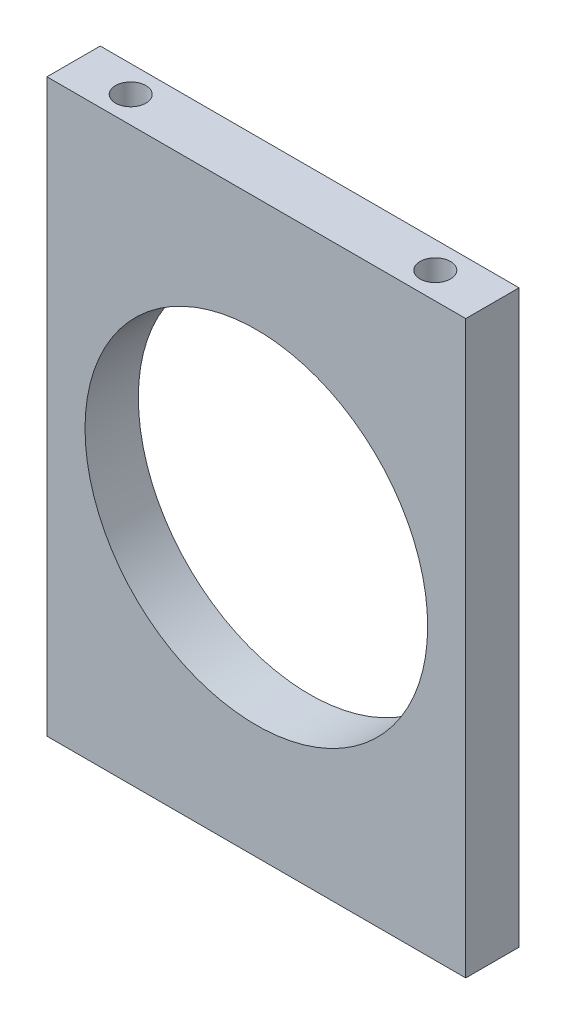
ISO-10303-21;
HEADER;
FILE_DESCRIPTION(('STEP AP214'),'2;1');
FILE_NAME('part.step','',(''),(''),'','','');
FILE_SCHEMA(('AUTOMOTIVE_DESIGN { 1 0 10303 214 1 1 1 1 }'));
ENDSEC;
DATA;
#1=APPLICATION_CONTEXT('core data for automotive mechanical design processes');
#2=APPLICATION_PROTOCOL_DEFINITION('international standard','automotive_design',2000,#1);
#3=PRODUCT_CONTEXT('',#1,'mechanical');
#4=PRODUCT('Part','Part','',(#3));
#5=PRODUCT_RELATED_PRODUCT_CATEGORY('part','',(#4));
#6=PRODUCT_DEFINITION_FORMATION('','',#4);
#7=PRODUCT_DEFINITION_CONTEXT('part definition',#1,'design');
#8=PRODUCT_DEFINITION('design','',#6,#7);
#9=PRODUCT_DEFINITION_SHAPE('','',#8);
#10=(LENGTH_UNIT() NAMED_UNIT(*) SI_UNIT(.MILLI.,.METRE.));
#11=(NAMED_UNIT(*) PLANE_ANGLE_UNIT() SI_UNIT($,.RADIAN.));
#12=(NAMED_UNIT(*) SI_UNIT($,.STERADIAN.) SOLID_ANGLE_UNIT());
#13=UNCERTAINTY_MEASURE_WITH_UNIT(LENGTH_MEASURE(1.E-05),#10,'distance_accuracy_value','');
#14=(GEOMETRIC_REPRESENTATION_CONTEXT(3) GLOBAL_UNCERTAINTY_ASSIGNED_CONTEXT((#13)) GLOBAL_UNIT_ASSIGNED_CONTEXT((#10,
#11,#12)) REPRESENTATION_CONTEXT('',''));
#15=CARTESIAN_POINT('',(0.,0.,0.));
#16=DIRECTION('',(0.,0.,1.));
#17=DIRECTION('',(1.,0.,0.));
#18=AXIS2_PLACEMENT_3D('',#15,#16,#17);
#19=CARTESIAN_POINT('',(0.,0.,7.));
#20=DIRECTION('',(0.,0.,1.));
#21=DIRECTION('',(1.,0.,0.));
#22=AXIS2_PLACEMENT_3D('',#19,#20,#21);
#23=PLANE('',#22);
#24=DIRECTION('',(0.,1.,0.));
#25=VECTOR('',#24,1.);
#26=CARTESIAN_POINT('',(27.5,37.5,7.));
#27=LINE('',#26,#25);
#28=CARTESIAN_POINT('',(27.5,-37.5,7.));
#29=VERTEX_POINT('',#28);
#30=CARTESIAN_POINT('',(27.5,37.5,7.));
#31=VERTEX_POINT('',#30);
#32=EDGE_CURVE('E86',#29,#31,#27,.T.);
#33=ORIENTED_EDGE('',*,*,#32,.T.);
#34=DIRECTION('',(-1.,0.,0.));
#35=VECTOR('',#34,1.);
#36=CARTESIAN_POINT('',(-27.5,37.5,7.));
#37=LINE('',#36,#35);
#38=CARTESIAN_POINT('',(-27.5,37.5,7.));
#39=VERTEX_POINT('',#38);
#40=EDGE_CURVE('E81',#31,#39,#37,.T.);
#41=ORIENTED_EDGE('',*,*,#40,.T.);
#42=DIRECTION('',(0.,-1.,0.));
#43=VECTOR('',#42,1.);
#44=CARTESIAN_POINT('',(-27.5,37.5,7.));
#45=LINE('',#44,#43);
#46=CARTESIAN_POINT('',(-27.5,-37.5,7.));
#47=VERTEX_POINT('',#46);
#48=EDGE_CURVE('E84',#39,#47,#45,.T.);
#49=ORIENTED_EDGE('',*,*,#48,.T.);
#50=DIRECTION('',(1.,0.,0.));
#51=VECTOR('',#50,1.);
#52=CARTESIAN_POINT('',(-27.5,-37.5,7.));
#53=LINE('',#52,#51);
#54=EDGE_CURVE('E51',#47,#29,#53,.T.);
#55=ORIENTED_EDGE('',*,*,#54,.T.);
#56=EDGE_LOOP('',(#33,#41,#49,#55));
#57=FACE_BOUND('',#56,.T.);
#58=CARTESIAN_POINT('',(0.,0.,7.));
#59=DIRECTION('',(0.,0.,1.));
#60=DIRECTION('',(1.,0.,0.));
#61=AXIS2_PLACEMENT_3D('',#58,#59,#60);
#62=CIRCLE('',#61,22.5);
#63=CARTESIAN_POINT('',(22.5,0.,7.));
#64=VERTEX_POINT('',#63);
#65=EDGE_CURVE('E101',#64,#64,#62,.T.);
#66=ORIENTED_EDGE('',*,*,#65,.F.);
#67=EDGE_LOOP('',(#66));
#68=FACE_BOUND('',#67,.T.);
#69=ADVANCED_FACE('F34',(#57,#68),#23,.T.);
#70=CARTESIAN_POINT('',(0.,0.,0.));
#71=DIRECTION('',(0.,0.,1.));
#72=DIRECTION('',(1.,0.,0.));
#73=AXIS2_PLACEMENT_3D('',#70,#71,#72);
#74=PLANE('',#73);
#75=DIRECTION('',(0.,1.,0.));
#76=VECTOR('',#75,1.);
#77=CARTESIAN_POINT('',(27.5,37.5,0.));
#78=LINE('',#77,#76);
#79=CARTESIAN_POINT('',(27.5,-37.5,0.));
#80=VERTEX_POINT('',#79);
#81=CARTESIAN_POINT('',(27.5,37.5,0.));
#82=VERTEX_POINT('',#81);
#83=EDGE_CURVE('E98',#80,#82,#78,.T.);
#84=ORIENTED_EDGE('',*,*,#83,.F.);
#85=DIRECTION('',(1.,0.,0.));
#86=VECTOR('',#85,1.);
#87=CARTESIAN_POINT('',(-27.5,-37.5,0.));
#88=LINE('',#87,#86);
#89=CARTESIAN_POINT('',(-27.5,-37.5,0.));
#90=VERTEX_POINT('',#89);
#91=EDGE_CURVE('E74',#90,#80,#88,.T.);
#92=ORIENTED_EDGE('',*,*,#91,.F.);
#93=DIRECTION('',(0.,-1.,0.));
#94=VECTOR('',#93,1.);
#95=CARTESIAN_POINT('',(-27.5,37.5,0.));
#96=LINE('',#95,#94);
#97=CARTESIAN_POINT('',(-27.5,37.5,0.));
#98=VERTEX_POINT('',#97);
#99=EDGE_CURVE('E68',#98,#90,#96,.T.);
#100=ORIENTED_EDGE('',*,*,#99,.F.);
#101=DIRECTION('',(-1.,0.,0.));
#102=VECTOR('',#101,1.);
#103=CARTESIAN_POINT('',(-27.5,37.5,0.));
#104=LINE('',#103,#102);
#105=EDGE_CURVE('E90',#82,#98,#104,.T.);
#106=ORIENTED_EDGE('',*,*,#105,.F.);
#107=EDGE_LOOP('',(#84,#92,#100,#106));
#108=FACE_BOUND('',#107,.T.);
#109=CARTESIAN_POINT('',(0.,0.,0.));
#110=DIRECTION('',(0.,0.,1.));
#111=DIRECTION('',(1.,0.,0.));
#112=AXIS2_PLACEMENT_3D('',#109,#110,#111);
#113=CIRCLE('',#112,22.5);
#114=CARTESIAN_POINT('',(22.5,0.,0.));
#115=VERTEX_POINT('',#114);
#116=EDGE_CURVE('E113',#115,#115,#113,.T.);
#117=ORIENTED_EDGE('',*,*,#116,.T.);
#118=EDGE_LOOP('',(#117));
#119=FACE_BOUND('',#118,.T.);
#120=ADVANCED_FACE('F109',(#108,#119),#74,.F.);
#121=CARTESIAN_POINT('',(27.5,37.5,7.));
#122=DIRECTION('',(-1.,0.,0.));
#123=DIRECTION('',(0.,-1.,0.));
#124=AXIS2_PLACEMENT_3D('',#121,#122,#123);
#125=PLANE('',#124);
#126=ORIENTED_EDGE('',*,*,#83,.T.);
#127=DIRECTION('',(0.,0.,-1.));
#128=VECTOR('',#127,1.);
#129=CARTESIAN_POINT('',(27.5,37.5,7.));
#130=LINE('',#129,#128);
#131=EDGE_CURVE('E11',#31,#82,#130,.T.);
#132=ORIENTED_EDGE('',*,*,#131,.F.);
#133=ORIENTED_EDGE('',*,*,#32,.F.);
#134=DIRECTION('',(0.,0.,-1.));
#135=VECTOR('',#134,1.);
#136=CARTESIAN_POINT('',(27.5,-37.5,7.));
#137=LINE('',#136,#135);
#138=EDGE_CURVE('E94',#29,#80,#137,.T.);
#139=ORIENTED_EDGE('',*,*,#138,.T.);
#140=EDGE_LOOP('',(#126,#132,#133,#139));
#141=FACE_BOUND('',#140,.T.);
#142=ADVANCED_FACE('F36',(#141),#125,.F.);
#143=CARTESIAN_POINT('',(-27.5,37.5,7.));
#144=DIRECTION('',(0.,-1.,0.));
#145=DIRECTION('',(0.,0.,-1.));
#146=AXIS2_PLACEMENT_3D('',#143,#144,#145);
#147=PLANE('',#146);
#148=CARTESIAN_POINT('',(-20.,37.5,3.5));
#149=DIRECTION('',(0.,1.,0.));
#150=DIRECTION('',(0.,0.,1.));
#151=AXIS2_PLACEMENT_3D('',#148,#149,#150);
#152=CIRCLE('',#151,2.);
#153=CARTESIAN_POINT('',(-20.,37.5,5.5));
#154=VERTEX_POINT('',#153);
#155=EDGE_CURVE('E126',#154,#154,#152,.T.);
#156=ORIENTED_EDGE('',*,*,#155,.F.);
#157=EDGE_LOOP('',(#156));
#158=FACE_BOUND('',#157,.T.);
#159=CARTESIAN_POINT('',(20.,37.5,3.50000000000008));
#160=DIRECTION('',(0.,1.,0.));
#161=DIRECTION('',(0.,0.,-1.));
#162=AXIS2_PLACEMENT_3D('',#159,#160,#161);
#163=CIRCLE('',#162,2.);
#164=CARTESIAN_POINT('',(20.,37.5,1.50000000000007));
#165=VERTEX_POINT('',#164);
#166=EDGE_CURVE('E119',#165,#165,#163,.T.);
#167=ORIENTED_EDGE('',*,*,#166,.F.);
#168=EDGE_LOOP('',(#167));
#169=FACE_BOUND('',#168,.T.);
#170=ORIENTED_EDGE('',*,*,#105,.T.);
#171=DIRECTION('',(0.,0.,-1.));
#172=VECTOR('',#171,1.);
#173=CARTESIAN_POINT('',(-27.5,37.5,7.));
#174=LINE('',#173,#172);
#175=EDGE_CURVE('E43',#39,#98,#174,.T.);
#176=ORIENTED_EDGE('',*,*,#175,.F.);
#177=ORIENTED_EDGE('',*,*,#40,.F.);
#178=ORIENTED_EDGE('',*,*,#131,.T.);
#179=EDGE_LOOP('',(#170,#176,#177,#178));
#180=FACE_BOUND('',#179,.T.);
#181=ADVANCED_FACE('F89',(#158,#169,#180),#147,.F.);
#182=CARTESIAN_POINT('',(-27.5,37.5,7.));
#183=DIRECTION('',(1.,0.,0.));
#184=DIRECTION('',(0.,1.,0.));
#185=AXIS2_PLACEMENT_3D('',#182,#183,#184);
#186=PLANE('',#185);
#187=ORIENTED_EDGE('',*,*,#99,.T.);
#188=DIRECTION('',(0.,0.,-1.));
#189=VECTOR('',#188,1.);
#190=CARTESIAN_POINT('',(-27.5,-37.5,7.));
#191=LINE('',#190,#189);
#192=EDGE_CURVE('E91',#47,#90,#191,.T.);
#193=ORIENTED_EDGE('',*,*,#192,.F.);
#194=ORIENTED_EDGE('',*,*,#48,.F.);
#195=ORIENTED_EDGE('',*,*,#175,.T.);
#196=EDGE_LOOP('',(#187,#193,#194,#195));
#197=FACE_BOUND('',#196,.T.);
#198=ADVANCED_FACE('F92',(#197),#186,.F.);
#199=CARTESIAN_POINT('',(-27.5,-37.5,7.));
#200=DIRECTION('',(0.,1.,0.));
#201=DIRECTION('',(0.,0.,1.));
#202=AXIS2_PLACEMENT_3D('',#199,#200,#201);
#203=PLANE('',#202);
#204=CARTESIAN_POINT('',(-20.,-37.5,3.5));
#205=DIRECTION('',(0.,-1.,0.));
#206=DIRECTION('',(0.,0.,-1.));
#207=AXIS2_PLACEMENT_3D('',#204,#205,#206);
#208=CIRCLE('',#207,2.);
#209=CARTESIAN_POINT('',(-20.,-37.5,1.5));
#210=VERTEX_POINT('',#209);
#211=EDGE_CURVE('E137',#210,#210,#208,.T.);
#212=ORIENTED_EDGE('',*,*,#211,.F.);
#213=EDGE_LOOP('',(#212));
#214=FACE_BOUND('',#213,.T.);
#215=CARTESIAN_POINT('',(20.,-37.5,3.50000000000002));
#216=DIRECTION('',(0.,-1.,0.));
#217=DIRECTION('',(0.,0.,1.));
#218=AXIS2_PLACEMENT_3D('',#215,#216,#217);
#219=CIRCLE('',#218,2.);
#220=CARTESIAN_POINT('',(20.,-37.5,5.50000000000002));
#221=VERTEX_POINT('',#220);
#222=EDGE_CURVE('E131',#221,#221,#219,.T.);
#223=ORIENTED_EDGE('',*,*,#222,.F.);
#224=EDGE_LOOP('',(#223));
#225=FACE_BOUND('',#224,.T.);
#226=ORIENTED_EDGE('',*,*,#91,.T.);
#227=ORIENTED_EDGE('',*,*,#138,.F.);
#228=ORIENTED_EDGE('',*,*,#54,.F.);
#229=ORIENTED_EDGE('',*,*,#192,.T.);
#230=EDGE_LOOP('',(#226,#227,#228,#229));
#231=FACE_BOUND('',#230,.T.);
#232=ADVANCED_FACE('F106',(#214,#225,#231),#203,.F.);
#233=CARTESIAN_POINT('',(0.,0.,7.));
#234=DIRECTION('',(0.,0.,-1.));
#235=DIRECTION('',(-1.,0.,0.));
#236=AXIS2_PLACEMENT_3D('',#233,#234,#235);
#237=CYLINDRICAL_SURFACE('',#236,22.5);
#238=ORIENTED_EDGE('',*,*,#65,.T.);
#239=EDGE_LOOP('',(#238));
#240=FACE_BOUND('',#239,.T.);
#241=ORIENTED_EDGE('',*,*,#116,.F.);
#242=EDGE_LOOP('',(#241));
#243=FACE_BOUND('',#242,.T.);
#244=ADVANCED_FACE('F154',(#240,#243),#237,.F.);
#245=CARTESIAN_POINT('',(20.,22.5,3.50000000000008));
#246=DIRECTION('',(0.,1.,0.));
#247=DIRECTION('',(0.,0.,1.));
#248=AXIS2_PLACEMENT_3D('',#245,#246,#247);
#249=CYLINDRICAL_SURFACE('',#248,2.);
#250=CARTESIAN_POINT('',(20.,22.5,3.50000000000008));
#251=DIRECTION('',(0.,1.,0.));
#252=DIRECTION('',(0.,0.,-1.));
#253=AXIS2_PLACEMENT_3D('',#250,#251,#252);
#254=CIRCLE('',#253,2.);
#255=CARTESIAN_POINT('',(20.,22.5,1.50000000000007));
#256=VERTEX_POINT('',#255);
#257=EDGE_CURVE('E122',#256,#256,#254,.T.);
#258=ORIENTED_EDGE('',*,*,#257,.F.);
#259=EDGE_LOOP('',(#258));
#260=FACE_BOUND('',#259,.T.);
#261=ORIENTED_EDGE('',*,*,#166,.T.);
#262=EDGE_LOOP('',(#261));
#263=FACE_BOUND('',#262,.T.);
#264=ADVANCED_FACE('F192',(#260,#263),#249,.F.);
#265=CARTESIAN_POINT('',(20.,22.5,3.50000000000008));
#266=DIRECTION('',(0.,-1.,0.));
#267=DIRECTION('',(0.,0.,-1.));
#268=AXIS2_PLACEMENT_3D('',#265,#266,#267);
#269=PLANE('',#268);
#270=ORIENTED_EDGE('',*,*,#257,.T.);
#271=EDGE_LOOP('',(#270));
#272=FACE_BOUND('',#271,.T.);
#273=ADVANCED_FACE('F194',(#272),#269,.F.);
#274=CARTESIAN_POINT('',(-20.,22.5,3.5));
#275=DIRECTION('',(0.,1.,0.));
#276=DIRECTION('',(0.,0.,1.));
#277=AXIS2_PLACEMENT_3D('',#274,#275,#276);
#278=CYLINDRICAL_SURFACE('',#277,2.);
#279=CARTESIAN_POINT('',(-20.,22.5,3.5));
#280=DIRECTION('',(0.,1.,0.));
#281=DIRECTION('',(0.,0.,1.));
#282=AXIS2_PLACEMENT_3D('',#279,#280,#281);
#283=CIRCLE('',#282,2.);
#284=CARTESIAN_POINT('',(-20.,22.5,5.5));
#285=VERTEX_POINT('',#284);
#286=EDGE_CURVE('E116',#285,#285,#283,.T.);
#287=ORIENTED_EDGE('',*,*,#286,.F.);
#288=EDGE_LOOP('',(#287));
#289=FACE_BOUND('',#288,.T.);
#290=ORIENTED_EDGE('',*,*,#155,.T.);
#291=EDGE_LOOP('',(#290));
#292=FACE_BOUND('',#291,.T.);
#293=ADVANCED_FACE('F169',(#289,#292),#278,.F.);
#294=CARTESIAN_POINT('',(-20.,22.5,3.5));
#295=DIRECTION('',(0.,1.,0.));
#296=DIRECTION('',(0.,0.,1.));
#297=AXIS2_PLACEMENT_3D('',#294,#295,#296);
#298=PLANE('',#297);
#299=ORIENTED_EDGE('',*,*,#286,.T.);
#300=EDGE_LOOP('',(#299));
#301=FACE_BOUND('',#300,.T.);
#302=ADVANCED_FACE('F160',(#301),#298,.T.);
#303=CARTESIAN_POINT('',(20.,-22.5,3.50000000000002));
#304=DIRECTION('',(0.,-1.,0.));
#305=DIRECTION('',(0.,0.,-1.));
#306=AXIS2_PLACEMENT_3D('',#303,#304,#305);
#307=CYLINDRICAL_SURFACE('',#306,2.);
#308=CARTESIAN_POINT('',(20.,-22.5,3.50000000000002));
#309=DIRECTION('',(0.,-1.,0.));
#310=DIRECTION('',(0.,0.,1.));
#311=AXIS2_PLACEMENT_3D('',#308,#309,#310);
#312=CIRCLE('',#311,2.);
#313=CARTESIAN_POINT('',(20.,-22.5,5.50000000000002));
#314=VERTEX_POINT('',#313);
#315=EDGE_CURVE('E134',#314,#314,#312,.T.);
#316=ORIENTED_EDGE('',*,*,#315,.F.);
#317=EDGE_LOOP('',(#316));
#318=FACE_BOUND('',#317,.T.);
#319=ORIENTED_EDGE('',*,*,#222,.T.);
#320=EDGE_LOOP('',(#319));
#321=FACE_BOUND('',#320,.T.);
#322=ADVANCED_FACE('F158',(#318,#321),#307,.F.);
#323=CARTESIAN_POINT('',(20.,-22.5,3.50000000000002));
#324=DIRECTION('',(0.,1.,0.));
#325=DIRECTION('',(0.,0.,1.));
#326=AXIS2_PLACEMENT_3D('',#323,#324,#325);
#327=PLANE('',#326);
#328=ORIENTED_EDGE('',*,*,#315,.T.);
#329=EDGE_LOOP('',(#328));
#330=FACE_BOUND('',#329,.T.);
#331=ADVANCED_FACE('F148',(#330),#327,.F.);
#332=CARTESIAN_POINT('',(-20.,-22.5,3.5));
#333=DIRECTION('',(0.,-1.,0.));
#334=DIRECTION('',(0.,0.,-1.));
#335=AXIS2_PLACEMENT_3D('',#332,#333,#334);
#336=CYLINDRICAL_SURFACE('',#335,2.);
#337=CARTESIAN_POINT('',(-20.,-22.5,3.5));
#338=DIRECTION('',(0.,-1.,0.));
#339=DIRECTION('',(0.,0.,-1.));
#340=AXIS2_PLACEMENT_3D('',#337,#338,#339);
#341=CIRCLE('',#340,2.);
#342=CARTESIAN_POINT('',(-20.,-22.5,1.5));
#343=VERTEX_POINT('',#342);
#344=EDGE_CURVE('E123',#343,#343,#341,.T.);
#345=ORIENTED_EDGE('',*,*,#344,.F.);
#346=EDGE_LOOP('',(#345));
#347=FACE_BOUND('',#346,.T.);
#348=ORIENTED_EDGE('',*,*,#211,.T.);
#349=EDGE_LOOP('',(#348));
#350=FACE_BOUND('',#349,.T.);
#351=ADVANCED_FACE('F145',(#347,#350),#336,.F.);
#352=CARTESIAN_POINT('',(-20.,-22.5,3.5));
#353=DIRECTION('',(0.,-1.,0.));
#354=DIRECTION('',(0.,0.,-1.));
#355=AXIS2_PLACEMENT_3D('',#352,#353,#354);
#356=PLANE('',#355);
#357=ORIENTED_EDGE('',*,*,#344,.T.);
#358=EDGE_LOOP('',(#357));
#359=FACE_BOUND('',#358,.T.);
#360=ADVANCED_FACE('F143',(#359),#356,.T.);
#361=CLOSED_SHELL('',(#69,#120,#142,#181,#198,#232,#244,#264,#273,#293,#302,#322,#331,#351,#360));
#362=MANIFOLD_SOLID_BREP('B2',#361);
#363=ADVANCED_BREP_SHAPE_REPRESENTATION('',(#18,#362),#14);
#364=SHAPE_DEFINITION_REPRESENTATION(#9,#363);
ENDSEC;
END-ISO-10303-21;
